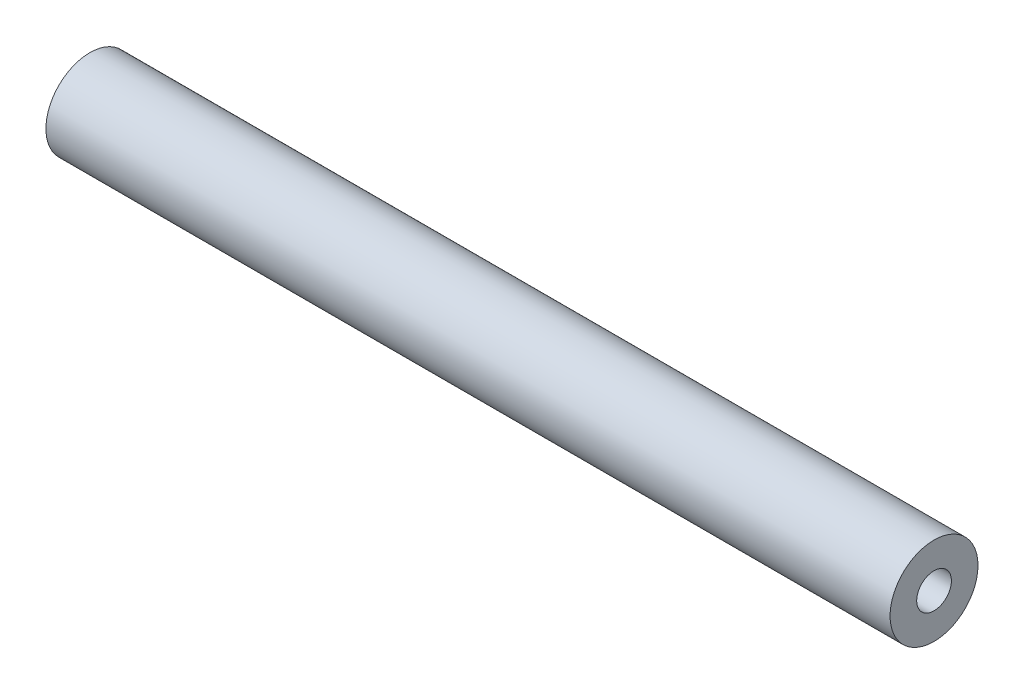
ISO-10303-21;
HEADER;
FILE_DESCRIPTION(('STEP AP214'),'2;1');
FILE_NAME('part.step','',(''),(''),'','','');
FILE_SCHEMA(('AUTOMOTIVE_DESIGN { 1 0 10303 214 1 1 1 1 }'));
ENDSEC;
DATA;
#1=APPLICATION_CONTEXT('core data for automotive mechanical design processes');
#2=APPLICATION_PROTOCOL_DEFINITION('international standard','automotive_design',2000,#1);
#3=PRODUCT_CONTEXT('',#1,'mechanical');
#4=PRODUCT('Part','Part','',(#3));
#5=PRODUCT_RELATED_PRODUCT_CATEGORY('part','',(#4));
#6=PRODUCT_DEFINITION_FORMATION('','',#4);
#7=PRODUCT_DEFINITION_CONTEXT('part definition',#1,'design');
#8=PRODUCT_DEFINITION('design','',#6,#7);
#9=PRODUCT_DEFINITION_SHAPE('','',#8);
#10=(LENGTH_UNIT() NAMED_UNIT(*) SI_UNIT(.MILLI.,.METRE.));
#11=(NAMED_UNIT(*) PLANE_ANGLE_UNIT() SI_UNIT($,.RADIAN.));
#12=(NAMED_UNIT(*) SI_UNIT($,.STERADIAN.) SOLID_ANGLE_UNIT());
#13=UNCERTAINTY_MEASURE_WITH_UNIT(LENGTH_MEASURE(1.E-05),#10,'distance_accuracy_value','');
#14=(GEOMETRIC_REPRESENTATION_CONTEXT(3) GLOBAL_UNCERTAINTY_ASSIGNED_CONTEXT((#13)) GLOBAL_UNIT_ASSIGNED_CONTEXT((#10,
#11,#12)) REPRESENTATION_CONTEXT('',''));
#15=CARTESIAN_POINT('',(0.,0.,0.));
#16=DIRECTION('',(0.,0.,1.));
#17=DIRECTION('',(1.,0.,0.));
#18=AXIS2_PLACEMENT_3D('',#15,#16,#17);
#19=CARTESIAN_POINT('',(231.7115,0.,0.));
#20=DIRECTION('',(1.,0.,0.));
#21=DIRECTION('',(0.,0.,-1.));
#22=AXIS2_PLACEMENT_3D('',#19,#20,#21);
#23=PLANE('',#22);
#24=CARTESIAN_POINT('',(231.7115,0.,0.));
#25=DIRECTION('',(1.,0.,0.));
#26=DIRECTION('',(0.,0.,-1.));
#27=AXIS2_PLACEMENT_3D('',#24,#25,#26);
#28=CIRCLE('',#27,24.13);
#29=CARTESIAN_POINT('',(231.7115,0.,-24.13));
#30=VERTEX_POINT('',#29);
#31=EDGE_CURVE('E10',#30,#30,#28,.T.);
#32=ORIENTED_EDGE('',*,*,#31,.T.);
#33=EDGE_LOOP('',(#32));
#34=FACE_BOUND('',#33,.T.);
#35=CARTESIAN_POINT('',(231.7115,0.,0.));
#36=DIRECTION('',(1.,0.,0.));
#37=DIRECTION('',(0.,0.,-1.));
#38=AXIS2_PLACEMENT_3D('',#35,#36,#37);
#39=CIRCLE('',#38,9.525);
#40=CARTESIAN_POINT('',(231.7115,0.,-9.525));
#41=VERTEX_POINT('',#40);
#42=EDGE_CURVE('E42',#41,#41,#39,.T.);
#43=ORIENTED_EDGE('',*,*,#42,.F.);
#44=EDGE_LOOP('',(#43));
#45=FACE_BOUND('',#44,.T.);
#46=ADVANCED_FACE('F31',(#34,#45),#23,.T.);
#47=CARTESIAN_POINT('',(-231.7115,0.,0.));
#48=DIRECTION('',(1.,0.,0.));
#49=DIRECTION('',(0.,0.,-1.));
#50=AXIS2_PLACEMENT_3D('',#47,#48,#49);
#51=PLANE('',#50);
#52=CARTESIAN_POINT('',(-231.7115,0.,0.));
#53=DIRECTION('',(1.,0.,0.));
#54=DIRECTION('',(0.,0.,-1.));
#55=AXIS2_PLACEMENT_3D('',#52,#53,#54);
#56=CIRCLE('',#55,24.13);
#57=CARTESIAN_POINT('',(-231.7115,0.,-24.13));
#58=VERTEX_POINT('',#57);
#59=EDGE_CURVE('E35',#58,#58,#56,.T.);
#60=ORIENTED_EDGE('',*,*,#59,.F.);
#61=EDGE_LOOP('',(#60));
#62=FACE_BOUND('',#61,.T.);
#63=CARTESIAN_POINT('',(-231.7115,0.,0.));
#64=DIRECTION('',(1.,0.,0.));
#65=DIRECTION('',(0.,0.,-1.));
#66=AXIS2_PLACEMENT_3D('',#63,#64,#65);
#67=CIRCLE('',#66,9.525);
#68=CARTESIAN_POINT('',(-231.7115,0.,-9.525));
#69=VERTEX_POINT('',#68);
#70=EDGE_CURVE('E44',#69,#69,#67,.T.);
#71=ORIENTED_EDGE('',*,*,#70,.T.);
#72=EDGE_LOOP('',(#71));
#73=FACE_BOUND('',#72,.T.);
#74=ADVANCED_FACE('F54',(#62,#73),#51,.F.);
#75=CARTESIAN_POINT('',(231.7115,0.,0.));
#76=DIRECTION('',(-1.,0.,0.));
#77=DIRECTION('',(0.,0.,1.));
#78=AXIS2_PLACEMENT_3D('',#75,#76,#77);
#79=CYLINDRICAL_SURFACE('',#78,24.13);
#80=ORIENTED_EDGE('',*,*,#31,.F.);
#81=EDGE_LOOP('',(#80));
#82=FACE_BOUND('',#81,.T.);
#83=ORIENTED_EDGE('',*,*,#59,.T.);
#84=EDGE_LOOP('',(#83));
#85=FACE_BOUND('',#84,.T.);
#86=ADVANCED_FACE('F33',(#82,#85),#79,.T.);
#87=CARTESIAN_POINT('',(231.7115,0.,0.));
#88=DIRECTION('',(-1.,0.,0.));
#89=DIRECTION('',(0.,0.,1.));
#90=AXIS2_PLACEMENT_3D('',#87,#88,#89);
#91=CYLINDRICAL_SURFACE('',#90,9.525);
#92=ORIENTED_EDGE('',*,*,#42,.T.);
#93=EDGE_LOOP('',(#92));
#94=FACE_BOUND('',#93,.T.);
#95=ORIENTED_EDGE('',*,*,#70,.F.);
#96=EDGE_LOOP('',(#95));
#97=FACE_BOUND('',#96,.T.);
#98=ADVANCED_FACE('F50',(#94,#97),#91,.F.);
#99=CLOSED_SHELL('',(#46,#74,#86,#98));
#100=MANIFOLD_SOLID_BREP('B2',#99);
#101=ADVANCED_BREP_SHAPE_REPRESENTATION('',(#18,#100),#14);
#102=SHAPE_DEFINITION_REPRESENTATION(#9,#101);
ENDSEC;
END-ISO-10303-21;
